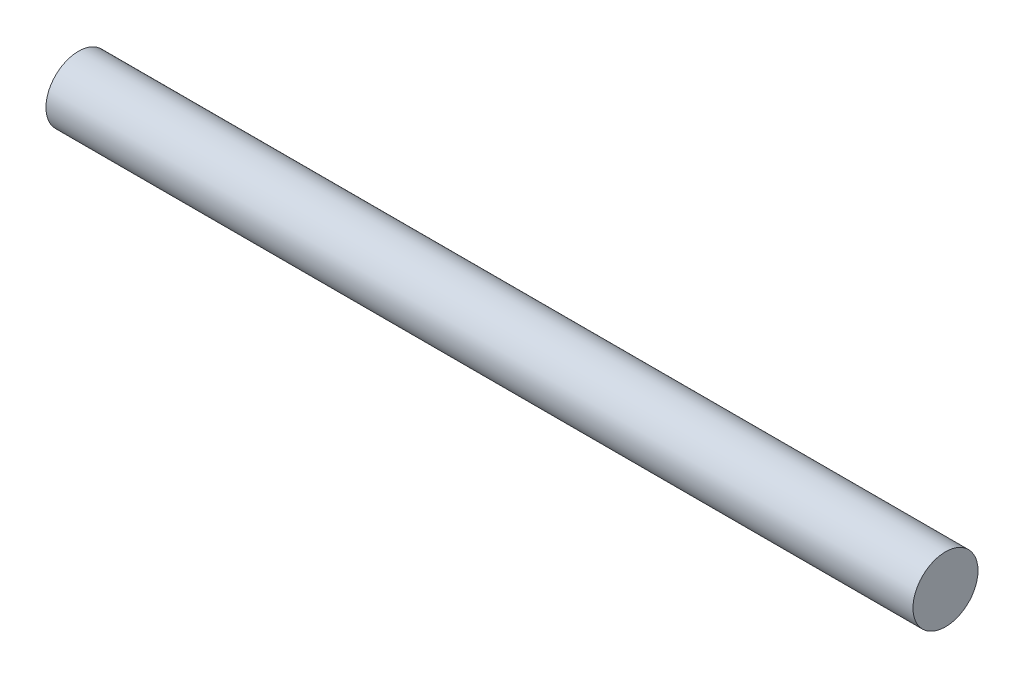
ISO-10303-21;
HEADER;
FILE_DESCRIPTION(('STEP AP214'),'2;1');
FILE_NAME('part.step','',(''),(''),'','','');
FILE_SCHEMA(('AUTOMOTIVE_DESIGN { 1 0 10303 214 1 1 1 1 }'));
ENDSEC;
DATA;
#1=APPLICATION_CONTEXT('core data for automotive mechanical design processes');
#2=APPLICATION_PROTOCOL_DEFINITION('international standard','automotive_design',2000,#1);
#3=PRODUCT_CONTEXT('',#1,'mechanical');
#4=PRODUCT('Part','Part','',(#3));
#5=PRODUCT_RELATED_PRODUCT_CATEGORY('part','',(#4));
#6=PRODUCT_DEFINITION_FORMATION('','',#4);
#7=PRODUCT_DEFINITION_CONTEXT('part definition',#1,'design');
#8=PRODUCT_DEFINITION('design','',#6,#7);
#9=PRODUCT_DEFINITION_SHAPE('','',#8);
#10=(LENGTH_UNIT() NAMED_UNIT(*) SI_UNIT(.MILLI.,.METRE.));
#11=(NAMED_UNIT(*) PLANE_ANGLE_UNIT() SI_UNIT($,.RADIAN.));
#12=(NAMED_UNIT(*) SI_UNIT($,.STERADIAN.) SOLID_ANGLE_UNIT());
#13=UNCERTAINTY_MEASURE_WITH_UNIT(LENGTH_MEASURE(1.E-05),#10,'distance_accuracy_value','');
#14=(GEOMETRIC_REPRESENTATION_CONTEXT(3) GLOBAL_UNCERTAINTY_ASSIGNED_CONTEXT((#13)) GLOBAL_UNIT_ASSIGNED_CONTEXT((#10,
#11,#12)) REPRESENTATION_CONTEXT('',''));
#15=CARTESIAN_POINT('',(0.,0.,0.));
#16=DIRECTION('',(0.,0.,1.));
#17=DIRECTION('',(1.,0.,0.));
#18=AXIS2_PLACEMENT_3D('',#15,#16,#17);
#19=CARTESIAN_POINT('',(127.,0.,0.));
#20=DIRECTION('',(-1.,0.,0.));
#21=DIRECTION('',(0.,0.,1.));
#22=AXIS2_PLACEMENT_3D('',#19,#20,#21);
#23=CYLINDRICAL_SURFACE('',#22,4.7625);
#24=CARTESIAN_POINT('',(127.,0.,0.));
#25=DIRECTION('',(1.,0.,0.));
#26=DIRECTION('',(0.,0.,-1.));
#27=AXIS2_PLACEMENT_3D('',#24,#25,#26);
#28=CIRCLE('',#27,4.7625);
#29=CARTESIAN_POINT('',(127.,0.,-4.7625));
#30=VERTEX_POINT('',#29);
#31=EDGE_CURVE('E10',#30,#30,#28,.T.);
#32=ORIENTED_EDGE('',*,*,#31,.F.);
#33=EDGE_LOOP('',(#32));
#34=FACE_BOUND('',#33,.T.);
#35=CARTESIAN_POINT('',(0.,0.,0.));
#36=DIRECTION('',(1.,0.,0.));
#37=DIRECTION('',(0.,0.,-1.));
#38=AXIS2_PLACEMENT_3D('',#35,#36,#37);
#39=CIRCLE('',#38,4.7625);
#40=CARTESIAN_POINT('',(0.,0.,-4.7625));
#41=VERTEX_POINT('',#40);
#42=EDGE_CURVE('E34',#41,#41,#39,.T.);
#43=ORIENTED_EDGE('',*,*,#42,.T.);
#44=EDGE_LOOP('',(#43));
#45=FACE_BOUND('',#44,.T.);
#46=ADVANCED_FACE('F31',(#34,#45),#23,.T.);
#47=CARTESIAN_POINT('',(127.,0.,0.));
#48=DIRECTION('',(1.,0.,0.));
#49=DIRECTION('',(0.,0.,-1.));
#50=AXIS2_PLACEMENT_3D('',#47,#48,#49);
#51=PLANE('',#50);
#52=ORIENTED_EDGE('',*,*,#31,.T.);
#53=EDGE_LOOP('',(#52));
#54=FACE_BOUND('',#53,.T.);
#55=ADVANCED_FACE('F46',(#54),#51,.T.);
#56=CARTESIAN_POINT('',(0.,0.,0.));
#57=DIRECTION('',(1.,0.,0.));
#58=DIRECTION('',(0.,0.,-1.));
#59=AXIS2_PLACEMENT_3D('',#56,#57,#58);
#60=PLANE('',#59);
#61=ORIENTED_EDGE('',*,*,#42,.F.);
#62=EDGE_LOOP('',(#61));
#63=FACE_BOUND('',#62,.T.);
#64=ADVANCED_FACE('F44',(#63),#60,.F.);
#65=CLOSED_SHELL('',(#46,#55,#64));
#66=MANIFOLD_SOLID_BREP('B2',#65);
#67=ADVANCED_BREP_SHAPE_REPRESENTATION('',(#18,#66),#14);
#68=SHAPE_DEFINITION_REPRESENTATION(#9,#67);
ENDSEC;
END-ISO-10303-21;
